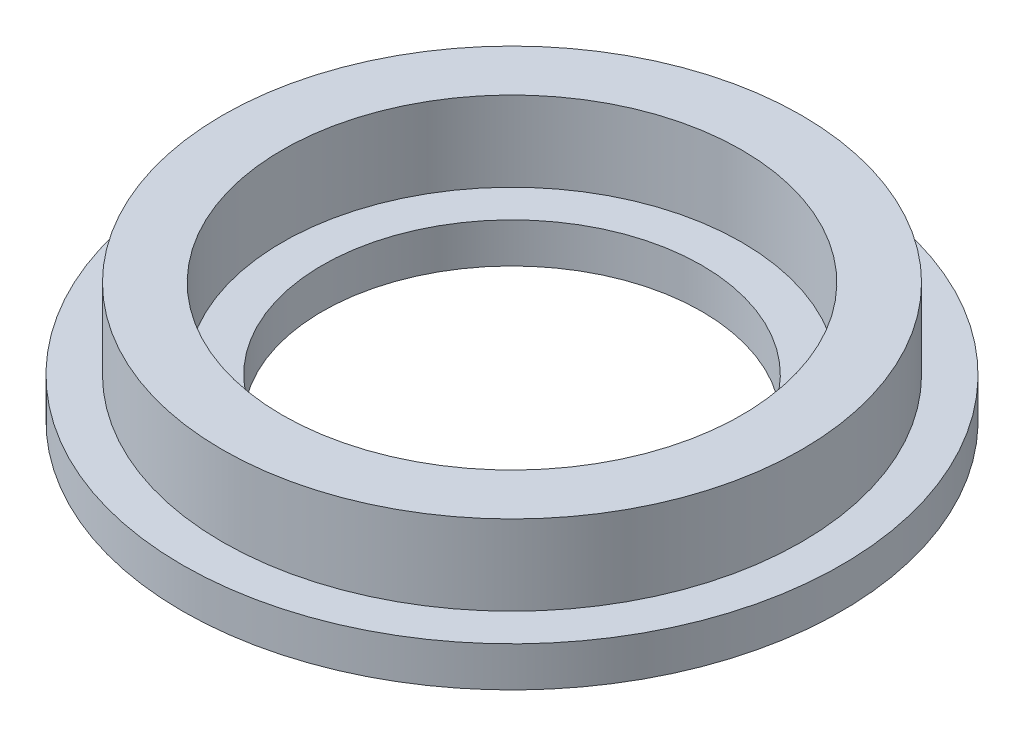
ISO-10303-21;
HEADER;
FILE_DESCRIPTION(('STEP AP214'),'2;1');
FILE_NAME('part.step','',(''),(''),'','','');
FILE_SCHEMA(('AUTOMOTIVE_DESIGN { 1 0 10303 214 1 1 1 1 }'));
ENDSEC;
DATA;
#1=APPLICATION_CONTEXT('core data for automotive mechanical design processes');
#2=APPLICATION_PROTOCOL_DEFINITION('international standard','automotive_design',2000,#1);
#3=PRODUCT_CONTEXT('',#1,'mechanical');
#4=PRODUCT('Part','Part','',(#3));
#5=PRODUCT_RELATED_PRODUCT_CATEGORY('part','',(#4));
#6=PRODUCT_DEFINITION_FORMATION('','',#4);
#7=PRODUCT_DEFINITION_CONTEXT('part definition',#1,'design');
#8=PRODUCT_DEFINITION('design','',#6,#7);
#9=PRODUCT_DEFINITION_SHAPE('','',#8);
#10=(LENGTH_UNIT() NAMED_UNIT(*) SI_UNIT(.MILLI.,.METRE.));
#11=(NAMED_UNIT(*) PLANE_ANGLE_UNIT() SI_UNIT($,.RADIAN.));
#12=(NAMED_UNIT(*) SI_UNIT($,.STERADIAN.) SOLID_ANGLE_UNIT());
#13=UNCERTAINTY_MEASURE_WITH_UNIT(LENGTH_MEASURE(1.E-05),#10,'distance_accuracy_value','');
#14=(GEOMETRIC_REPRESENTATION_CONTEXT(3) GLOBAL_UNCERTAINTY_ASSIGNED_CONTEXT((#13)) GLOBAL_UNIT_ASSIGNED_CONTEXT((#10,
#11,#12)) REPRESENTATION_CONTEXT('',''));
#15=CARTESIAN_POINT('',(0.,0.,0.));
#16=DIRECTION('',(0.,0.,1.));
#17=DIRECTION('',(1.,0.,0.));
#18=AXIS2_PLACEMENT_3D('',#15,#16,#17);
#19=CARTESIAN_POINT('',(0.,0.,0.));
#20=DIRECTION('',(0.,-1.,0.));
#21=DIRECTION('',(0.,0.,-1.));
#22=AXIS2_PLACEMENT_3D('',#19,#20,#21);
#23=CYLINDRICAL_SURFACE('',#22,9.5);
#24=CARTESIAN_POINT('',(0.,1.99999999999997,0.));
#25=DIRECTION('',(0.,-1.,0.));
#26=DIRECTION('',(0.,0.,-1.));
#27=AXIS2_PLACEMENT_3D('',#24,#25,#26);
#28=CIRCLE('',#27,9.5);
#29=CARTESIAN_POINT('',(0.,1.99999999999997,-9.5));
#30=VERTEX_POINT('',#29);
#31=EDGE_CURVE('E61',#30,#30,#28,.T.);
#32=ORIENTED_EDGE('',*,*,#31,.F.);
#33=EDGE_LOOP('',(#32));
#34=FACE_BOUND('',#33,.T.);
#35=CARTESIAN_POINT('',(0.,0.,0.));
#36=DIRECTION('',(0.,-1.,0.));
#37=DIRECTION('',(0.,0.,-1.));
#38=AXIS2_PLACEMENT_3D('',#35,#36,#37);
#39=CIRCLE('',#38,9.5);
#40=CARTESIAN_POINT('',(0.,0.,-9.5));
#41=VERTEX_POINT('',#40);
#42=EDGE_CURVE('E10',#41,#41,#39,.T.);
#43=ORIENTED_EDGE('',*,*,#42,.T.);
#44=EDGE_LOOP('',(#43));
#45=FACE_BOUND('',#44,.T.);
#46=ADVANCED_FACE('F33',(#34,#45),#23,.F.);
#47=CARTESIAN_POINT('',(-9.5,0.,0.));
#48=DIRECTION('',(0.,1.,0.));
#49=DIRECTION('',(0.,0.,1.));
#50=AXIS2_PLACEMENT_3D('',#47,#48,#49);
#51=PLANE('',#50);
#52=ORIENTED_EDGE('',*,*,#42,.F.);
#53=EDGE_LOOP('',(#52));
#54=FACE_BOUND('',#53,.T.);
#55=CARTESIAN_POINT('',(0.,0.,0.));
#56=DIRECTION('',(0.,-1.,0.));
#57=DIRECTION('',(0.,0.,-1.));
#58=AXIS2_PLACEMENT_3D('',#55,#56,#57);
#59=CIRCLE('',#58,16.5);
#60=CARTESIAN_POINT('',(0.,0.,-16.5));
#61=VERTEX_POINT('',#60);
#62=EDGE_CURVE('E39',#61,#61,#59,.T.);
#63=ORIENTED_EDGE('',*,*,#62,.T.);
#64=EDGE_LOOP('',(#63));
#65=FACE_BOUND('',#64,.T.);
#66=ADVANCED_FACE('F68',(#54,#65),#51,.F.);
#67=CARTESIAN_POINT('',(0.,0.,0.));
#68=DIRECTION('',(0.,-1.,0.));
#69=DIRECTION('',(0.,0.,-1.));
#70=AXIS2_PLACEMENT_3D('',#67,#68,#69);
#71=CYLINDRICAL_SURFACE('',#70,16.5);
#72=ORIENTED_EDGE('',*,*,#62,.F.);
#73=EDGE_LOOP('',(#72));
#74=FACE_BOUND('',#73,.T.);
#75=CARTESIAN_POINT('',(0.,2.,0.));
#76=DIRECTION('',(0.,-1.,0.));
#77=DIRECTION('',(0.,0.,-1.));
#78=AXIS2_PLACEMENT_3D('',#75,#76,#77);
#79=CIRCLE('',#78,16.5);
#80=CARTESIAN_POINT('',(0.,2.,-16.5));
#81=VERTEX_POINT('',#80);
#82=EDGE_CURVE('E43',#81,#81,#79,.T.);
#83=ORIENTED_EDGE('',*,*,#82,.T.);
#84=EDGE_LOOP('',(#83));
#85=FACE_BOUND('',#84,.T.);
#86=ADVANCED_FACE('F72',(#74,#85),#71,.T.);
#87=CARTESIAN_POINT('',(-16.5,1.99999999999998,0.));
#88=DIRECTION('',(0.,-1.,0.));
#89=DIRECTION('',(0.,0.,-1.));
#90=AXIS2_PLACEMENT_3D('',#87,#88,#89);
#91=PLANE('',#90);
#92=ORIENTED_EDGE('',*,*,#82,.F.);
#93=EDGE_LOOP('',(#92));
#94=FACE_BOUND('',#93,.T.);
#95=CARTESIAN_POINT('',(0.,1.99999999999997,0.));
#96=DIRECTION('',(0.,-1.,0.));
#97=DIRECTION('',(0.,0.,-1.));
#98=AXIS2_PLACEMENT_3D('',#95,#96,#97);
#99=CIRCLE('',#98,14.5);
#100=CARTESIAN_POINT('',(0.,1.99999999999997,-14.5));
#101=VERTEX_POINT('',#100);
#102=EDGE_CURVE('E47',#101,#101,#99,.T.);
#103=ORIENTED_EDGE('',*,*,#102,.T.);
#104=EDGE_LOOP('',(#103));
#105=FACE_BOUND('',#104,.T.);
#106=ADVANCED_FACE('F77',(#94,#105),#91,.F.);
#107=CARTESIAN_POINT('',(0.,0.,0.));
#108=DIRECTION('',(0.,-1.,0.));
#109=DIRECTION('',(0.,0.,-1.));
#110=AXIS2_PLACEMENT_3D('',#107,#108,#109);
#111=CYLINDRICAL_SURFACE('',#110,14.5);
#112=ORIENTED_EDGE('',*,*,#102,.F.);
#113=EDGE_LOOP('',(#112));
#114=FACE_BOUND('',#113,.T.);
#115=CARTESIAN_POINT('',(0.,5.99999999999997,0.));
#116=DIRECTION('',(0.,-1.,0.));
#117=DIRECTION('',(0.,0.,-1.));
#118=AXIS2_PLACEMENT_3D('',#115,#116,#117);
#119=CIRCLE('',#118,14.5);
#120=CARTESIAN_POINT('',(0.,5.99999999999997,-14.5));
#121=VERTEX_POINT('',#120);
#122=EDGE_CURVE('E52',#121,#121,#119,.T.);
#123=ORIENTED_EDGE('',*,*,#122,.T.);
#124=EDGE_LOOP('',(#123));
#125=FACE_BOUND('',#124,.T.);
#126=ADVANCED_FACE('F83',(#114,#125),#111,.T.);
#127=CARTESIAN_POINT('',(-14.5,5.99999999999997,0.));
#128=DIRECTION('',(0.,-1.,0.));
#129=DIRECTION('',(0.,0.,-1.));
#130=AXIS2_PLACEMENT_3D('',#127,#128,#129);
#131=PLANE('',#130);
#132=ORIENTED_EDGE('',*,*,#122,.F.);
#133=EDGE_LOOP('',(#132));
#134=FACE_BOUND('',#133,.T.);
#135=CARTESIAN_POINT('',(0.,5.99999999999997,0.));
#136=DIRECTION('',(0.,-1.,0.));
#137=DIRECTION('',(0.,0.,-1.));
#138=AXIS2_PLACEMENT_3D('',#135,#136,#137);
#139=CIRCLE('',#138,11.5);
#140=CARTESIAN_POINT('',(0.,5.99999999999997,-11.5));
#141=VERTEX_POINT('',#140);
#142=EDGE_CURVE('E55',#141,#141,#139,.T.);
#143=ORIENTED_EDGE('',*,*,#142,.T.);
#144=EDGE_LOOP('',(#143));
#145=FACE_BOUND('',#144,.T.);
#146=ADVANCED_FACE('F87',(#134,#145),#131,.F.);
#147=CARTESIAN_POINT('',(0.,0.,0.));
#148=DIRECTION('',(0.,-1.,0.));
#149=DIRECTION('',(0.,0.,-1.));
#150=AXIS2_PLACEMENT_3D('',#147,#148,#149);
#151=CYLINDRICAL_SURFACE('',#150,11.5);
#152=ORIENTED_EDGE('',*,*,#142,.F.);
#153=EDGE_LOOP('',(#152));
#154=FACE_BOUND('',#153,.T.);
#155=CARTESIAN_POINT('',(0.,1.99999999999997,0.));
#156=DIRECTION('',(0.,-1.,0.));
#157=DIRECTION('',(0.,0.,-1.));
#158=AXIS2_PLACEMENT_3D('',#155,#156,#157);
#159=CIRCLE('',#158,11.5);
#160=CARTESIAN_POINT('',(0.,1.99999999999997,-11.5));
#161=VERTEX_POINT('',#160);
#162=EDGE_CURVE('E58',#161,#161,#159,.T.);
#163=ORIENTED_EDGE('',*,*,#162,.T.);
#164=EDGE_LOOP('',(#163));
#165=FACE_BOUND('',#164,.T.);
#166=ADVANCED_FACE('F91',(#154,#165),#151,.F.);
#167=CARTESIAN_POINT('',(-9.5,1.99999999999997,0.));
#168=DIRECTION('',(0.,-1.,0.));
#169=DIRECTION('',(0.,0.,-1.));
#170=AXIS2_PLACEMENT_3D('',#167,#168,#169);
#171=PLANE('',#170);
#172=ORIENTED_EDGE('',*,*,#162,.F.);
#173=EDGE_LOOP('',(#172));
#174=FACE_BOUND('',#173,.T.);
#175=ORIENTED_EDGE('',*,*,#31,.T.);
#176=EDGE_LOOP('',(#175));
#177=FACE_BOUND('',#176,.T.);
#178=ADVANCED_FACE('F65',(#174,#177),#171,.F.);
#179=CLOSED_SHELL('',(#46,#66,#86,#106,#126,#146,#166,#178));
#180=MANIFOLD_SOLID_BREP('B2',#179);
#181=ADVANCED_BREP_SHAPE_REPRESENTATION('',(#18,#180),#14);
#182=SHAPE_DEFINITION_REPRESENTATION(#9,#181);
ENDSEC;
END-ISO-10303-21;
